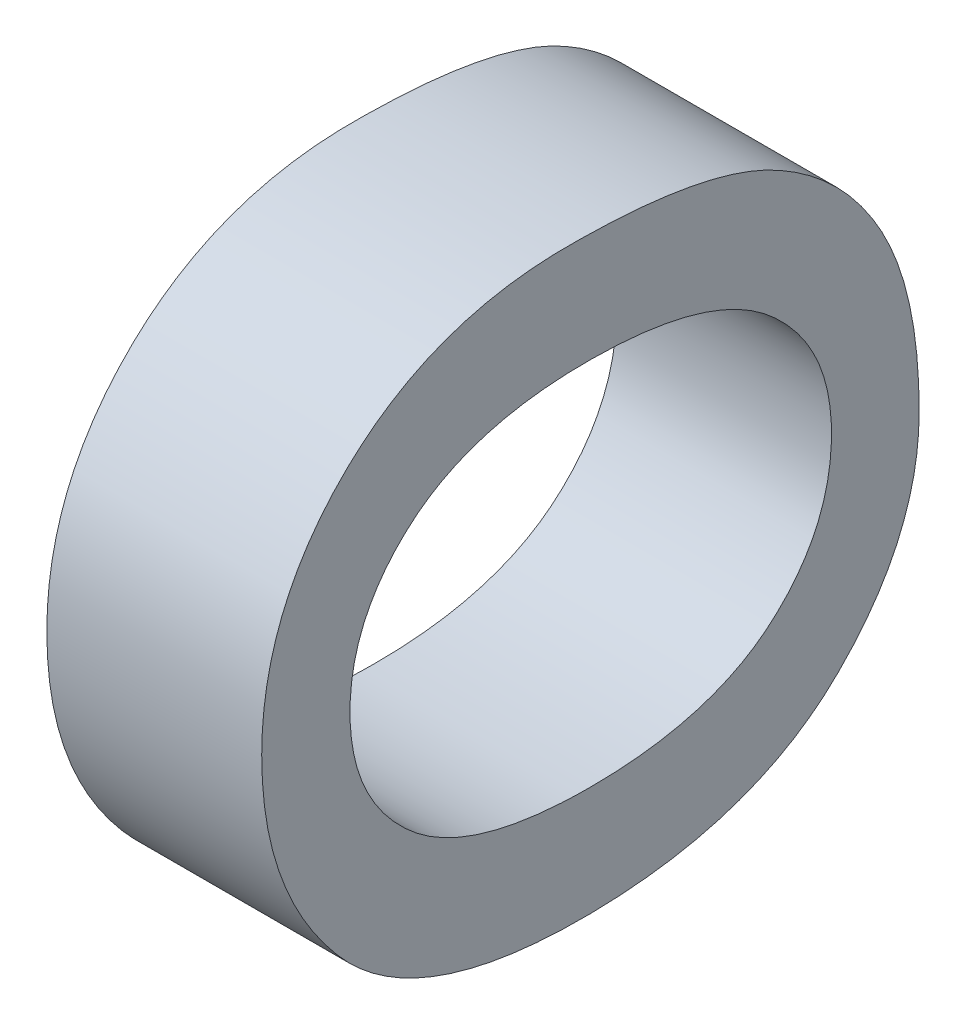
ISO-10303-21;
HEADER;
FILE_DESCRIPTION(('STEP AP214'),'2;1');
FILE_NAME('part.step','',(''),(''),'','','');
FILE_SCHEMA(('AUTOMOTIVE_DESIGN { 1 0 10303 214 1 1 1 1 }'));
ENDSEC;
DATA;
#1=APPLICATION_CONTEXT('core data for automotive mechanical design processes');
#2=APPLICATION_PROTOCOL_DEFINITION('international standard','automotive_design',2000,#1);
#3=PRODUCT_CONTEXT('',#1,'mechanical');
#4=PRODUCT('Part','Part','',(#3));
#5=PRODUCT_RELATED_PRODUCT_CATEGORY('part','',(#4));
#6=PRODUCT_DEFINITION_FORMATION('','',#4);
#7=PRODUCT_DEFINITION_CONTEXT('part definition',#1,'design');
#8=PRODUCT_DEFINITION('design','',#6,#7);
#9=PRODUCT_DEFINITION_SHAPE('','',#8);
#10=(LENGTH_UNIT() NAMED_UNIT(*) SI_UNIT(.MILLI.,.METRE.));
#11=(NAMED_UNIT(*) PLANE_ANGLE_UNIT() SI_UNIT($,.RADIAN.));
#12=(NAMED_UNIT(*) SI_UNIT($,.STERADIAN.) SOLID_ANGLE_UNIT());
#13=UNCERTAINTY_MEASURE_WITH_UNIT(LENGTH_MEASURE(1.E-05),#10,'distance_accuracy_value','');
#14=(GEOMETRIC_REPRESENTATION_CONTEXT(3) GLOBAL_UNCERTAINTY_ASSIGNED_CONTEXT((#13)) GLOBAL_UNIT_ASSIGNED_CONTEXT((#10,
#11,#12)) REPRESENTATION_CONTEXT('',''));
#15=CARTESIAN_POINT('',(0.,0.,0.));
#16=DIRECTION('',(0.,0.,1.));
#17=DIRECTION('',(1.,0.,0.));
#18=AXIS2_PLACEMENT_3D('',#15,#16,#17);
#19=CARTESIAN_POINT('',(4.55229940712881,-37.0973100637089,-8.87455840971013));
#20=DIRECTION('',(-1.,0.,0.));
#21=DIRECTION('',(0.,0.,1.));
#22=AXIS2_PLACEMENT_3D('',#19,#20,#21);
#23=PLANE('',#22);
#24=CARTESIAN_POINT('',(4.5522994071288,-37.0120297444608,-9.06579306499374));
#25=CARTESIAN_POINT('',(4.5522994071288,-37.0120297444608,-9.1220263906555));
#26=CARTESIAN_POINT('',(4.5522994071288,-36.9874965778731,-9.15000522670781));
#27=CARTESIAN_POINT('',(4.5522994071288,-36.9629634112854,-9.17798406276011));
#28=CARTESIAN_POINT('',(4.55229940712879,-36.925750181068,-9.17798406276011));
#29=CARTESIAN_POINT('',(4.55229940712879,-36.8888126044079,-9.17798406276011));
#30=CARTESIAN_POINT('',(4.55229940712878,-36.8642794378201,-9.14986739992922));
#31=CARTESIAN_POINT('',(4.55229940712878,-36.8397462712324,-9.12175073709833));
#32=CARTESIAN_POINT('',(4.55229940712878,-36.8397462712324,-9.06413914365073));
#33=CARTESIAN_POINT('',(4.55229940712878,-36.8397462712324,-9.00983539288912));
#34=CARTESIAN_POINT('',(4.55229940712878,-36.8644172645987,-8.98185655683683));
#35=CARTESIAN_POINT('',(4.55229940712878,-36.889088257965,-8.95387772078453));
#36=CARTESIAN_POINT('',(4.55229940712879,-36.925750181068,-8.95387772078453));
#37=CARTESIAN_POINT('',(4.5522994071288,-36.9629634112854,-8.95387772078453));
#38=CARTESIAN_POINT('',(4.5522994071288,-36.9874965778731,-8.98171873005824));
#39=CARTESIAN_POINT('',(4.5522994071288,-37.0120297444608,-9.00955973933197));
#40=CARTESIAN_POINT('',(4.5522994071288,-37.0120297444608,-9.06579306499374));
#41=(BOUNDED_CURVE() B_SPLINE_CURVE(2,(#24,#25,#26,#27,#28,#29,#30,#31,#32,#33,#34,#35,#36,#37,
#38,#39,#40),.UNSPECIFIED.,.T.,.F.) B_SPLINE_CURVE_WITH_KNOTS((3,2,2,2,2,2,2,2,3),(9.,10.,11.,
12.,13.,14.,15.,16.,17.),
.UNSPECIFIED.) CURVE() GEOMETRIC_REPRESENTATION_ITEM() RATIONAL_B_SPLINE_CURVE((1.,1.,1.,1.,1.,
1.,1.,1.,1.,1.,1.,1.,1.,1.,1.,1.,1.)) REPRESENTATION_ITEM(''));
#42=CARTESIAN_POINT('',(4.5522994071288,-37.0120297444608,-9.06579306499374));
#43=VERTEX_POINT('',#42);
#44=EDGE_CURVE('E11',#43,#43,#41,.T.);
#45=ORIENTED_EDGE('',*,*,#44,.T.);
#46=EDGE_LOOP('',(#45));
#47=FACE_BOUND('',#46,.T.);
#48=CARTESIAN_POINT('',(4.55229940712881,-37.0630256525365,-9.06220956875058));
#49=CARTESIAN_POINT('',(4.55229940712881,-37.0630256525365,-8.98447526562989));
#50=CARTESIAN_POINT('',(4.5522994071288,-36.9800539318297,-8.91280534076686));
#51=CARTESIAN_POINT('',(4.55229940712878,-36.8653820520488,-8.91280534076686));
#52=CARTESIAN_POINT('',(4.55229940712877,-36.7887503631568,-8.99191791167337));
#53=CARTESIAN_POINT('',(4.55229940712877,-36.7887503631568,-9.11816724085519));
#54=CARTESIAN_POINT('',(4.55229940712878,-36.8226557506881,-9.18294582678908));
#55=CARTESIAN_POINT('',(4.55229940712879,-36.8874343366221,-9.21878078922061));
#56=CARTESIAN_POINT('',(4.5522994071288,-36.987220924316,-9.21878078922061));
#57=CARTESIAN_POINT('',(4.55229940712881,-37.0630256525365,-9.13994387187126));
#58=CARTESIAN_POINT('',(4.55229940712881,-37.0630256525365,-9.06220956875058));
#59=(BOUNDED_CURVE() B_SPLINE_CURVE(2,(#48,#49,#50,#51,#52,#53,#54,#55,#56,#57,#58),
.UNSPECIFIED.,.T.,.F.) B_SPLINE_CURVE_WITH_KNOTS((3,1,1,1,1,1,1,1,1,3),(0.,1.,2.,3.,4.,5.,6.,7.,
8.,9.),.UNSPECIFIED.) CURVE() GEOMETRIC_REPRESENTATION_ITEM() RATIONAL_B_SPLINE_CURVE((1.,1.,1.,
1.,1.,1.,1.,1.,1.,1.,1.)) REPRESENTATION_ITEM(''));
#60=CARTESIAN_POINT('',(4.55229940712881,-37.0630256525365,-9.06579306499374));
#61=VERTEX_POINT('',#60);
#62=EDGE_CURVE('E55',#61,#61,#59,.T.);
#63=ORIENTED_EDGE('',*,*,#62,.T.);
#64=EDGE_LOOP('',(#63));
#65=FACE_BOUND('',#64,.T.);
#66=ADVANCED_FACE('F16',(#47,#65),#23,.T.);
#67=CARTESIAN_POINT('',(4.65229940712881,-37.0973100637089,-8.87455840971013));
#68=DIRECTION('',(1.,0.,0.));
#69=DIRECTION('',(0.,1.,0.));
#70=AXIS2_PLACEMENT_3D('',#67,#68,#69);
#71=PLANE('',#70);
#72=CARTESIAN_POINT('',(4.6522994071288,-37.0120297444608,-9.06579306499374));
#73=CARTESIAN_POINT('',(4.65229940712881,-37.0120297444608,-9.1220263906555));
#74=CARTESIAN_POINT('',(4.6522994071288,-36.9874965778731,-9.15000522670781));
#75=CARTESIAN_POINT('',(4.6522994071288,-36.9629634112854,-9.17798406276011));
#76=CARTESIAN_POINT('',(4.65229940712879,-36.925750181068,-9.17798406276011));
#77=CARTESIAN_POINT('',(4.65229940712879,-36.8888126044078,-9.17798406276011));
#78=CARTESIAN_POINT('',(4.65229940712878,-36.8642794378201,-9.14986739992922));
#79=CARTESIAN_POINT('',(4.65229940712878,-36.8397462712324,-9.12175073709833));
#80=CARTESIAN_POINT('',(4.65229940712878,-36.8397462712324,-9.06413914365074));
#81=CARTESIAN_POINT('',(4.65229940712878,-36.8397462712324,-9.00983539288912));
#82=CARTESIAN_POINT('',(4.65229940712878,-36.8644172645987,-8.98185655683683));
#83=CARTESIAN_POINT('',(4.65229940712879,-36.889088257965,-8.95387772078453));
#84=CARTESIAN_POINT('',(4.65229940712879,-36.925750181068,-8.95387772078453));
#85=CARTESIAN_POINT('',(4.6522994071288,-36.9629634112854,-8.95387772078453));
#86=CARTESIAN_POINT('',(4.6522994071288,-36.9874965778731,-8.98171873005825));
#87=CARTESIAN_POINT('',(4.6522994071288,-37.0120297444608,-9.00955973933197));
#88=CARTESIAN_POINT('',(4.6522994071288,-37.0120297444608,-9.06579306499374));
#89=(BOUNDED_CURVE() B_SPLINE_CURVE(2,(#72,#73,#74,#75,#76,#77,#78,#79,#80,#81,#82,#83,#84,#85,
#86,#87,#88),.UNSPECIFIED.,.T.,.F.) B_SPLINE_CURVE_WITH_KNOTS((3,2,2,2,2,2,2,2,3),(9.,10.,11.,
12.,13.,14.,15.,16.,17.),
.UNSPECIFIED.) CURVE() GEOMETRIC_REPRESENTATION_ITEM() RATIONAL_B_SPLINE_CURVE((1.,1.,1.,1.,1.,
1.,1.,1.,1.,1.,1.,1.,1.,1.,1.,1.,1.)) REPRESENTATION_ITEM(''));
#90=CARTESIAN_POINT('',(4.6522994071288,-37.0120297444608,-9.06579306499374));
#91=VERTEX_POINT('',#90);
#92=EDGE_CURVE('E57',#91,#91,#89,.T.);
#93=ORIENTED_EDGE('',*,*,#92,.F.);
#94=EDGE_LOOP('',(#93));
#95=FACE_BOUND('',#94,.T.);
#96=CARTESIAN_POINT('',(4.65229940712881,-37.0630256525365,-9.06220956875058));
#97=CARTESIAN_POINT('',(4.65229940712881,-37.0630256525365,-8.9844752656299));
#98=CARTESIAN_POINT('',(4.6522994071288,-36.9800539318296,-8.91280534076686));
#99=CARTESIAN_POINT('',(4.65229940712878,-36.8653820520488,-8.91280534076686));
#100=CARTESIAN_POINT('',(4.65229940712877,-36.7887503631568,-8.99191791167337));
#101=CARTESIAN_POINT('',(4.65229940712877,-36.7887503631568,-9.11816724085519));
#102=CARTESIAN_POINT('',(4.65229940712878,-36.8226557506881,-9.18294582678909));
#103=CARTESIAN_POINT('',(4.65229940712879,-36.887434336622,-9.21878078922061));
#104=CARTESIAN_POINT('',(4.6522994071288,-36.987220924316,-9.21878078922061));
#105=CARTESIAN_POINT('',(4.65229940712881,-37.0630256525365,-9.13994387187126));
#106=CARTESIAN_POINT('',(4.65229940712881,-37.0630256525365,-9.06220956875058));
#107=(BOUNDED_CURVE() B_SPLINE_CURVE(2,(#96,#97,#98,#99,#100,#101,#102,#103,#104,#105,#106),
.UNSPECIFIED.,.T.,.F.) B_SPLINE_CURVE_WITH_KNOTS((3,1,1,1,1,1,1,1,1,3),(0.,1.,2.,3.,4.,5.,6.,7.,
8.,9.),.UNSPECIFIED.) CURVE() GEOMETRIC_REPRESENTATION_ITEM() RATIONAL_B_SPLINE_CURVE((1.,1.,1.,
1.,1.,1.,1.,1.,1.,1.,1.)) REPRESENTATION_ITEM(''));
#108=CARTESIAN_POINT('',(4.65229940712881,-37.0630256525365,-9.06579306499374));
#109=VERTEX_POINT('',#108);
#110=EDGE_CURVE('E65',#109,#109,#107,.T.);
#111=ORIENTED_EDGE('',*,*,#110,.F.);
#112=EDGE_LOOP('',(#111));
#113=FACE_BOUND('',#112,.T.);
#114=ADVANCED_FACE('F103',(#95,#113),#71,.T.);
#115=CARTESIAN_POINT('',(4.6522994071288,-37.0120297444608,-9.06579306499374));
#116=CARTESIAN_POINT('',(4.5522994071288,-37.0120297444608,-9.06579306499374));
#117=CARTESIAN_POINT('',(4.65229940712881,-37.0120297444608,-9.1220263906555));
#118=CARTESIAN_POINT('',(4.5522994071288,-37.0120297444608,-9.1220263906555));
#119=CARTESIAN_POINT('',(4.6522994071288,-36.9874965778731,-9.15000522670781));
#120=CARTESIAN_POINT('',(4.5522994071288,-36.9874965778731,-9.15000522670781));
#121=CARTESIAN_POINT('',(4.6522994071288,-36.9629634112854,-9.17798406276011));
#122=CARTESIAN_POINT('',(4.5522994071288,-36.9629634112854,-9.17798406276011));
#123=CARTESIAN_POINT('',(4.65229940712879,-36.925750181068,-9.17798406276011));
#124=CARTESIAN_POINT('',(4.55229940712879,-36.925750181068,-9.17798406276011));
#125=CARTESIAN_POINT('',(4.65229940712879,-36.8888126044078,-9.17798406276011));
#126=CARTESIAN_POINT('',(4.55229940712879,-36.8888126044079,-9.17798406276011));
#127=CARTESIAN_POINT('',(4.65229940712878,-36.8642794378201,-9.14986739992922));
#128=CARTESIAN_POINT('',(4.55229940712878,-36.8642794378201,-9.14986739992922));
#129=CARTESIAN_POINT('',(4.65229940712878,-36.8397462712324,-9.12175073709833));
#130=CARTESIAN_POINT('',(4.55229940712878,-36.8397462712324,-9.12175073709833));
#131=CARTESIAN_POINT('',(4.65229940712878,-36.8397462712324,-9.06413914365074));
#132=CARTESIAN_POINT('',(4.55229940712878,-36.8397462712324,-9.06413914365073));
#133=CARTESIAN_POINT('',(4.65229940712878,-36.8397462712324,-9.00983539288912));
#134=CARTESIAN_POINT('',(4.55229940712878,-36.8397462712324,-9.00983539288912));
#135=CARTESIAN_POINT('',(4.65229940712878,-36.8644172645987,-8.98185655683683));
#136=CARTESIAN_POINT('',(4.55229940712878,-36.8644172645987,-8.98185655683683));
#137=CARTESIAN_POINT('',(4.65229940712879,-36.889088257965,-8.95387772078453));
#138=CARTESIAN_POINT('',(4.55229940712878,-36.889088257965,-8.95387772078453));
#139=CARTESIAN_POINT('',(4.65229940712879,-36.925750181068,-8.95387772078453));
#140=CARTESIAN_POINT('',(4.55229940712879,-36.925750181068,-8.95387772078453));
#141=CARTESIAN_POINT('',(4.6522994071288,-36.9629634112854,-8.95387772078453));
#142=CARTESIAN_POINT('',(4.5522994071288,-36.9629634112854,-8.95387772078453));
#143=CARTESIAN_POINT('',(4.6522994071288,-36.9874965778731,-8.98171873005825));
#144=CARTESIAN_POINT('',(4.5522994071288,-36.9874965778731,-8.98171873005824));
#145=CARTESIAN_POINT('',(4.6522994071288,-37.0120297444608,-9.00955973933197));
#146=CARTESIAN_POINT('',(4.5522994071288,-37.0120297444608,-9.00955973933197));
#147=CARTESIAN_POINT('',(4.6522994071288,-37.0120297444608,-9.06579306499374));
#148=CARTESIAN_POINT('',(4.5522994071288,-37.0120297444608,-9.06579306499374));
#149=(BOUNDED_SURFACE() B_SPLINE_SURFACE(2,1,((#115,#116),(#117,#118),(#119,#120),(#121,#122),
(#123,#124),(#125,#126),(#127,#128),(#129,#130),(#131,#132),(#133,#134),(#135,#136),(#137,#138),
(#139,#140),(#141,#142),(#143,#144),(#145,#146),(#147,#148)),.UNSPECIFIED.,.T.,.F.,
.F.) B_SPLINE_SURFACE_WITH_KNOTS((3,2,2,2,2,2,2,2,3),(2,2),(9.,10.,11.,12.,13.,14.,15.,16.,17.),
(0.,0.1),.UNSPECIFIED.) GEOMETRIC_REPRESENTATION_ITEM() RATIONAL_B_SPLINE_SURFACE(((1.,1.),(1.,
1.),(1.,1.),(1.,1.),(1.,1.),(1.,1.),(1.,1.),(1.,1.),(1.,1.),(1.,1.),(1.,1.),(1.,1.),(1.,1.),(1.,
1.),(1.,1.),(1.,1.),(1.,1.))) REPRESENTATION_ITEM('') SURFACE());
#150=CARTESIAN_POINT('',(4.6522994071288,-37.0120297444608,-9.06579306499374));
#151=CARTESIAN_POINT('',(4.5522994071288,-37.0120297444608,-9.06579306499374));
#152=(BOUNDED_CURVE() B_SPLINE_CURVE(1,(#150,#151),.UNSPECIFIED.,.F.,
.F.) B_SPLINE_CURVE_WITH_KNOTS((2,2),(0.,0.1),
.UNSPECIFIED.) CURVE() GEOMETRIC_REPRESENTATION_ITEM() RATIONAL_B_SPLINE_CURVE((1.,1.)) REPRESENTATION_ITEM(''));
#153=EDGE_CURVE('E28',#91,#43,#152,.T.);
#154=ORIENTED_EDGE('',*,*,#92,.T.);
#155=ORIENTED_EDGE('',*,*,#153,.T.);
#156=ORIENTED_EDGE('',*,*,#44,.F.);
#157=ORIENTED_EDGE('',*,*,#153,.F.);
#158=EDGE_LOOP('',(#154,#155,#156,#157));
#159=FACE_BOUND('',#158,.T.);
#160=ADVANCED_FACE('F100',(#159),#149,.T.);
#161=CARTESIAN_POINT('',(4.65229940712881,-37.0630256525365,-9.06220956875058));
#162=CARTESIAN_POINT('',(4.55229940712881,-37.0630256525365,-9.06220956875058));
#163=CARTESIAN_POINT('',(4.65229940712881,-37.0630256525365,-8.9844752656299));
#164=CARTESIAN_POINT('',(4.55229940712881,-37.0630256525365,-8.98447526562989));
#165=CARTESIAN_POINT('',(4.6522994071288,-36.9800539318296,-8.91280534076686));
#166=CARTESIAN_POINT('',(4.5522994071288,-36.9800539318297,-8.91280534076686));
#167=CARTESIAN_POINT('',(4.65229940712878,-36.8653820520488,-8.91280534076686));
#168=CARTESIAN_POINT('',(4.55229940712878,-36.8653820520488,-8.91280534076686));
#169=CARTESIAN_POINT('',(4.65229940712877,-36.7887503631568,-8.99191791167337));
#170=CARTESIAN_POINT('',(4.55229940712877,-36.7887503631568,-8.99191791167337));
#171=CARTESIAN_POINT('',(4.65229940712877,-36.7887503631568,-9.11816724085519));
#172=CARTESIAN_POINT('',(4.55229940712877,-36.7887503631568,-9.11816724085519));
#173=CARTESIAN_POINT('',(4.65229940712878,-36.8226557506881,-9.18294582678909));
#174=CARTESIAN_POINT('',(4.55229940712878,-36.8226557506881,-9.18294582678908));
#175=CARTESIAN_POINT('',(4.65229940712879,-36.887434336622,-9.21878078922061));
#176=CARTESIAN_POINT('',(4.55229940712879,-36.8874343366221,-9.21878078922061));
#177=CARTESIAN_POINT('',(4.6522994071288,-36.987220924316,-9.21878078922061));
#178=CARTESIAN_POINT('',(4.5522994071288,-36.987220924316,-9.21878078922061));
#179=CARTESIAN_POINT('',(4.65229940712881,-37.0630256525365,-9.13994387187126));
#180=CARTESIAN_POINT('',(4.55229940712881,-37.0630256525365,-9.13994387187126));
#181=CARTESIAN_POINT('',(4.65229940712881,-37.0630256525365,-9.06220956875058));
#182=CARTESIAN_POINT('',(4.55229940712881,-37.0630256525365,-9.06220956875058));
#183=(BOUNDED_SURFACE() B_SPLINE_SURFACE(2,1,((#161,#162),(#163,#164),(#165,#166),(#167,#168),
(#169,#170),(#171,#172),(#173,#174),(#175,#176),(#177,#178),(#179,#180),(#181,#182)),
.UNSPECIFIED.,.T.,.F.,.F.) B_SPLINE_SURFACE_WITH_KNOTS((3,1,1,1,1,1,1,1,1,3),(2,2),(0.,1.,2.,3.,
4.,5.,6.,7.,8.,9.),(0.,0.1),
.UNSPECIFIED.) GEOMETRIC_REPRESENTATION_ITEM() RATIONAL_B_SPLINE_SURFACE(((1.,1.),(1.,1.),(1.,
1.),(1.,1.),(1.,1.),(1.,1.),(1.,1.),(1.,1.),(1.,1.),(1.,1.),(1.,1.))) REPRESENTATION_ITEM('') SURFACE());
#184=CARTESIAN_POINT('',(4.65229940712881,-37.0630052861124,-9.06579283213991));
#185=CARTESIAN_POINT('',(4.55229940712881,-37.0630052861124,-9.06579283213991));
#186=(BOUNDED_CURVE() B_SPLINE_CURVE(1,(#184,#185),.UNSPECIFIED.,.F.,
.F.) B_SPLINE_CURVE_WITH_KNOTS((2,2),(0.,0.1),
.UNSPECIFIED.) CURVE() GEOMETRIC_REPRESENTATION_ITEM() RATIONAL_B_SPLINE_CURVE((1.,1.)) REPRESENTATION_ITEM(''));
#187=EDGE_CURVE('E50',#109,#61,#186,.T.);
#188=ORIENTED_EDGE('',*,*,#110,.T.);
#189=ORIENTED_EDGE('',*,*,#187,.T.);
#190=ORIENTED_EDGE('',*,*,#62,.F.);
#191=ORIENTED_EDGE('',*,*,#187,.F.);
#192=EDGE_LOOP('',(#188,#189,#190,#191));
#193=FACE_BOUND('',#192,.T.);
#194=ADVANCED_FACE('F89',(#193),#183,.T.);
#195=CLOSED_SHELL('',(#66,#114,#160,#194));
#196=MANIFOLD_SOLID_BREP('B1',#195);
#197=ADVANCED_BREP_SHAPE_REPRESENTATION('',(#18,#196),#14);
#198=SHAPE_DEFINITION_REPRESENTATION(#9,#197);
ENDSEC;
END-ISO-10303-21;
